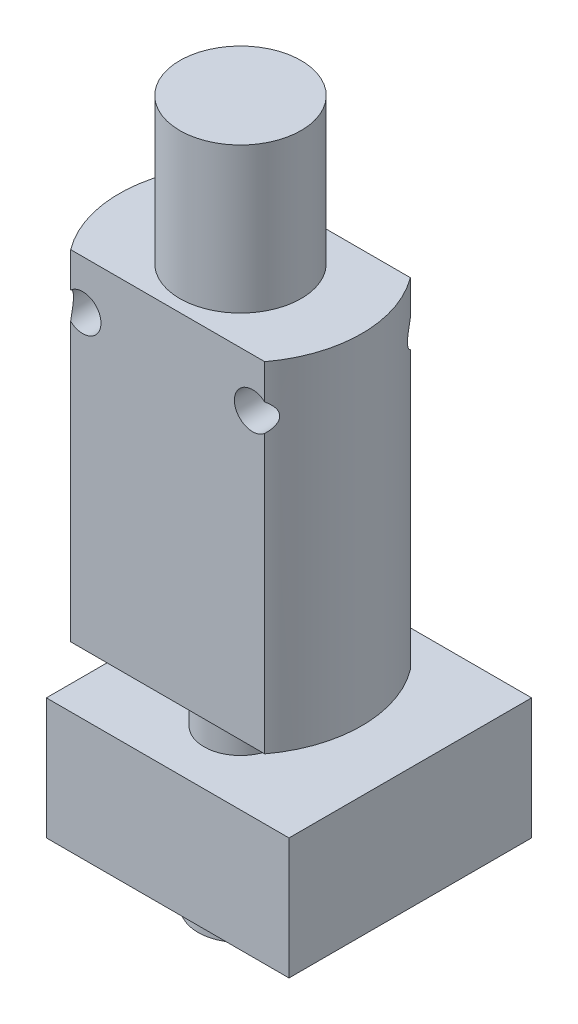
ISO-10303-21;
HEADER;
FILE_DESCRIPTION(('STEP AP214'),'2;1');
FILE_NAME('part.step','',(''),(''),'','','');
FILE_SCHEMA(('AUTOMOTIVE_DESIGN { 1 0 10303 214 1 1 1 1 }'));
ENDSEC;
DATA;
#1=APPLICATION_CONTEXT('core data for automotive mechanical design processes');
#2=APPLICATION_PROTOCOL_DEFINITION('international standard','automotive_design',2000,#1);
#3=PRODUCT_CONTEXT('',#1,'mechanical');
#4=PRODUCT('Part','Part','',(#3));
#5=PRODUCT_RELATED_PRODUCT_CATEGORY('part','',(#4));
#6=PRODUCT_DEFINITION_FORMATION('','',#4);
#7=PRODUCT_DEFINITION_CONTEXT('part definition',#1,'design');
#8=PRODUCT_DEFINITION('design','',#6,#7);
#9=PRODUCT_DEFINITION_SHAPE('','',#8);
#10=(LENGTH_UNIT() NAMED_UNIT(*) SI_UNIT(.MILLI.,.METRE.));
#11=(NAMED_UNIT(*) PLANE_ANGLE_UNIT() SI_UNIT($,.RADIAN.));
#12=(NAMED_UNIT(*) SI_UNIT($,.STERADIAN.) SOLID_ANGLE_UNIT());
#13=UNCERTAINTY_MEASURE_WITH_UNIT(LENGTH_MEASURE(1.E-05),#10,'distance_accuracy_value','');
#14=(GEOMETRIC_REPRESENTATION_CONTEXT(3) GLOBAL_UNCERTAINTY_ASSIGNED_CONTEXT((#13)) GLOBAL_UNIT_ASSIGNED_CONTEXT((#10,
#11,#12)) REPRESENTATION_CONTEXT('',''));
#15=CARTESIAN_POINT('',(0.,0.,0.));
#16=DIRECTION('',(0.,0.,1.));
#17=DIRECTION('',(1.,0.,0.));
#18=AXIS2_PLACEMENT_3D('',#15,#16,#17);
#19=CARTESIAN_POINT('',(-10.,14.,6.));
#20=DIRECTION('',(0.,-1.,0.));
#21=DIRECTION('',(0.,0.,-1.));
#22=AXIS2_PLACEMENT_3D('',#19,#20,#21);
#23=PLANE('',#22);
#24=CARTESIAN_POINT('',(0.,14.,0.));
#25=DIRECTION('',(0.,1.,0.));
#26=DIRECTION('',(0.,0.,1.));
#27=AXIS2_PLACEMENT_3D('',#24,#25,#26);
#28=CIRCLE('',#27,5.);
#29=CARTESIAN_POINT('',(0.,14.,5.));
#30=VERTEX_POINT('',#29);
#31=EDGE_CURVE('E144',#30,#30,#28,.T.);
#32=ORIENTED_EDGE('',*,*,#31,.F.);
#33=EDGE_LOOP('',(#32));
#34=FACE_BOUND('',#33,.T.);
#35=CARTESIAN_POINT('',(0.,14.,0.));
#36=DIRECTION('',(0.,1.,0.));
#37=DIRECTION('',(0.,0.,1.));
#38=AXIS2_PLACEMENT_3D('',#35,#36,#37);
#39=CIRCLE('',#38,9.99999999999999);
#40=CARTESIAN_POINT('',(-7.99999999999999,14.,-6.));
#41=VERTEX_POINT('',#40);
#42=CARTESIAN_POINT('',(-7.99999999999999,14.,6.));
#43=VERTEX_POINT('',#42);
#44=EDGE_CURVE('E121',#41,#43,#39,.T.);
#45=ORIENTED_EDGE('',*,*,#44,.T.);
#46=DIRECTION('',(-1.,0.,0.));
#47=VECTOR('',#46,1.);
#48=CARTESIAN_POINT('',(-10.,14.,6.));
#49=LINE('',#48,#47);
#50=CARTESIAN_POINT('',(7.99999999999999,14.,6.));
#51=VERTEX_POINT('',#50);
#52=EDGE_CURVE('E125',#51,#43,#49,.T.);
#53=ORIENTED_EDGE('',*,*,#52,.F.);
#54=CARTESIAN_POINT('',(0.,14.,0.));
#55=DIRECTION('',(0.,1.,0.));
#56=DIRECTION('',(0.,0.,1.));
#57=AXIS2_PLACEMENT_3D('',#54,#55,#56);
#58=CIRCLE('',#57,9.99999999999999);
#59=CARTESIAN_POINT('',(7.99999999999999,14.,-6.));
#60=VERTEX_POINT('',#59);
#61=EDGE_CURVE('E199',#51,#60,#58,.T.);
#62=ORIENTED_EDGE('',*,*,#61,.T.);
#63=DIRECTION('',(-1.,0.,0.));
#64=VECTOR('',#63,1.);
#65=CARTESIAN_POINT('',(-10.,14.,-6.));
#66=LINE('',#65,#64);
#67=EDGE_CURVE('E127',#60,#41,#66,.T.);
#68=ORIENTED_EDGE('',*,*,#67,.T.);
#69=EDGE_LOOP('',(#45,#53,#62,#68));
#70=FACE_BOUND('',#69,.T.);
#71=ADVANCED_FACE('F33',(#34,#70),#23,.F.);
#72=CARTESIAN_POINT('',(-10.,-14.,6.));
#73=DIRECTION('',(0.,1.,0.));
#74=DIRECTION('',(0.,0.,1.));
#75=AXIS2_PLACEMENT_3D('',#72,#73,#74);
#76=PLANE('',#75);
#77=CARTESIAN_POINT('',(0.,-14.,0.));
#78=DIRECTION('',(0.,1.,0.));
#79=DIRECTION('',(0.,0.,1.));
#80=AXIS2_PLACEMENT_3D('',#77,#78,#79);
#81=CIRCLE('',#80,3.);
#82=CARTESIAN_POINT('',(0.,-14.,3.));
#83=VERTEX_POINT('',#82);
#84=EDGE_CURVE('E223',#83,#83,#81,.T.);
#85=ORIENTED_EDGE('',*,*,#84,.T.);
#86=EDGE_LOOP('',(#85));
#87=FACE_BOUND('',#86,.T.);
#88=DIRECTION('',(1.,0.,0.));
#89=VECTOR('',#88,1.);
#90=CARTESIAN_POINT('',(-10.,-14.,6.));
#91=LINE('',#90,#89);
#92=CARTESIAN_POINT('',(-7.99999999999999,-14.,6.));
#93=VERTEX_POINT('',#92);
#94=CARTESIAN_POINT('',(7.99999999999999,-14.,6.));
#95=VERTEX_POINT('',#94);
#96=EDGE_CURVE('E140',#93,#95,#91,.T.);
#97=ORIENTED_EDGE('',*,*,#96,.F.);
#98=CARTESIAN_POINT('',(0.,-14.,0.));
#99=DIRECTION('',(0.,1.,0.));
#100=DIRECTION('',(0.,0.,1.));
#101=AXIS2_PLACEMENT_3D('',#98,#99,#100);
#102=CIRCLE('',#101,9.99999999999999);
#103=CARTESIAN_POINT('',(-7.99999999999999,-14.,-6.));
#104=VERTEX_POINT('',#103);
#105=EDGE_CURVE('E200',#93,#104,#102,.F.);
#106=ORIENTED_EDGE('',*,*,#105,.T.);
#107=DIRECTION('',(1.,0.,0.));
#108=VECTOR('',#107,1.);
#109=CARTESIAN_POINT('',(-10.,-14.,-6.));
#110=LINE('',#109,#108);
#111=CARTESIAN_POINT('',(7.99999999999999,-14.,-6.));
#112=VERTEX_POINT('',#111);
#113=EDGE_CURVE('E141',#104,#112,#110,.T.);
#114=ORIENTED_EDGE('',*,*,#113,.T.);
#115=CARTESIAN_POINT('',(0.,-14.,0.));
#116=DIRECTION('',(0.,1.,0.));
#117=DIRECTION('',(0.,0.,1.));
#118=AXIS2_PLACEMENT_3D('',#115,#116,#117);
#119=CIRCLE('',#118,9.99999999999999);
#120=EDGE_CURVE('E128',#112,#95,#119,.F.);
#121=ORIENTED_EDGE('',*,*,#120,.T.);
#122=EDGE_LOOP('',(#97,#106,#114,#121));
#123=FACE_BOUND('',#122,.T.);
#124=ADVANCED_FACE('F205',(#87,#123),#76,.F.);
#125=CARTESIAN_POINT('',(-7.,10.,6.));
#126=DIRECTION('',(0.,0.,-1.));
#127=DIRECTION('',(-1.,0.,0.));
#128=AXIS2_PLACEMENT_3D('',#125,#126,#127);
#129=CYLINDRICAL_SURFACE('',#128,1.5);
#130=CARTESIAN_POINT('',(-7.,10.,-6.));
#131=DIRECTION('',(0.,0.,1.));
#132=DIRECTION('',(1.,0.,0.));
#133=AXIS2_PLACEMENT_3D('',#130,#131,#132);
#134=CIRCLE('',#133,1.5);
#135=CARTESIAN_POINT('',(-7.99999999999999,8.8819660112501,-6.));
#136=VERTEX_POINT('',#135);
#137=CARTESIAN_POINT('',(-7.99999999999999,11.1180339887499,-6.));
#138=VERTEX_POINT('',#137);
#139=EDGE_CURVE('E149',#136,#138,#134,.T.);
#140=ORIENTED_EDGE('',*,*,#139,.F.);
#141=CARTESIAN_POINT('',(-7.99999999999999,8.8819660112501,-6.));
#142=CARTESIAN_POINT('',(-8.03319709795339,8.91168999587392,-5.95574757794856));
#143=CARTESIAN_POINT('',(-8.06547382531949,8.94319406453813,-5.91193650763562));
#144=CARTESIAN_POINT('',(-8.12806349588235,9.01024924885044,-5.82558234333872));
#145=CARTESIAN_POINT('',(-8.15836573250745,9.04581994379503,-5.78304674477553));
#146=CARTESIAN_POINT('',(-8.21709784680618,9.12192094350839,-5.6992959478821));
#147=CARTESIAN_POINT('',(-8.24548102185268,9.16253286471241,-5.65812137582313));
#148=CARTESIAN_POINT('',(-8.2991820476017,9.24853986586232,-5.57905460198178));
#149=CARTESIAN_POINT('',(-8.32450671243462,9.29392387521647,-5.54115515917385));
#150=CARTESIAN_POINT('',(-8.36858418886494,9.3842199558626,-5.47432222692192));
#151=CARTESIAN_POINT('',(-8.38776138312471,9.42852544710386,-5.44485872774962));
#152=CARTESIAN_POINT('',(-8.42243915145812,9.52134456248971,-5.39106107623512));
#153=CARTESIAN_POINT('',(-8.43795154621582,9.56984394823762,-5.36671046153633));
#154=CARTESIAN_POINT('',(-8.46460110637092,9.67174421117296,-5.32458104602582));
#155=CARTESIAN_POINT('',(-8.47567021392915,9.72520694015195,-5.30690470094116));
#156=CARTESIAN_POINT('',(-8.49194866496654,9.83520431252895,-5.28081977259772));
#157=CARTESIAN_POINT('',(-8.49716945739679,9.89173272601723,-5.27239308241005));
#158=CARTESIAN_POINT('',(-8.50081944583781,9.99819648261795,-5.26650508032341));
#159=CARTESIAN_POINT('',(-8.50004219971293,10.0480352597205,-5.26776248596406));
#160=CARTESIAN_POINT('',(-8.49363811880348,10.146587853215,-5.27808168264521));
#161=CARTESIAN_POINT('',(-8.48800735531078,10.1953007254282,-5.28714979610468));
#162=CARTESIAN_POINT('',(-8.47127513329529,10.2973459180014,-5.31392281268726));
#163=CARTESIAN_POINT('',(-8.45947758401049,10.3502693365455,-5.33272261032079));
#164=CARTESIAN_POINT('',(-8.43130597602798,10.4518344295103,-5.37715277375631));
#165=CARTESIAN_POINT('',(-8.41492382133668,10.5004683273753,-5.40279521929137));
#166=CARTESIAN_POINT('',(-8.36861987041464,10.6187450069766,-5.47438161937196));
#167=CARTESIAN_POINT('',(-8.33619690891963,10.6853035208725,-5.52375215997205));
#168=CARTESIAN_POINT('',(-8.26517248972191,10.8089780262943,-5.62947761030729));
#169=CARTESIAN_POINT('',(-8.22655015352859,10.8660607343773,-5.6858559711276));
#170=CARTESIAN_POINT('',(-8.15666561018673,10.9562121489143,-5.78544215884129));
#171=CARTESIAN_POINT('',(-8.12660113188093,10.9913924316923,-5.82761873016638));
#172=CARTESIAN_POINT('',(-8.06464717168066,11.0576149614166,-5.91305749310683));
#173=CARTESIAN_POINT('',(-8.0327762062478,11.0886910901623,-5.95630676548155));
#174=CARTESIAN_POINT('',(-8.,11.1180339887499,-6.));
#175=B_SPLINE_CURVE_WITH_KNOTS('',3,(#141,#142,#143,#144,#145,#146,#147,#148,#149,#150,#151,
#152,#153,#154,#155,#156,#157,#158,#159,#160,#161,#162,#163,#164,#165,#166,#167,#168,#169,#170,
#171,#172,#173,#174),.UNSPECIFIED.,.F.,.F.,(4,2,2,2,2,2,2,2,2,2,2,2,2,2,2,2,4),(0.,
0.188433784760338,0.377816388273991,0.570809072083472,0.76336352449458,0.932633231778437,
1.10134927478578,1.27255905579028,1.44343307910128,1.59212863584515,1.7409446682314,
1.9121689192985,2.08369746568321,2.34918211584102,2.6155803962468,2.80325566076793,
2.98926916684157),.UNSPECIFIED.);
#176=EDGE_CURVE('E40',#136,#138,#175,.T.);
#177=ORIENTED_EDGE('',*,*,#176,.T.);
#178=EDGE_LOOP('',(#140,#177));
#179=FACE_BOUND('',#178,.T.);
#180=CARTESIAN_POINT('',(-7.,10.,6.));
#181=DIRECTION('',(0.,0.,1.));
#182=DIRECTION('',(1.,0.,0.));
#183=AXIS2_PLACEMENT_3D('',#180,#181,#182);
#184=CIRCLE('',#183,1.5);
#185=CARTESIAN_POINT('',(-7.99999999999999,8.8819660112501,6.));
#186=VERTEX_POINT('',#185);
#187=CARTESIAN_POINT('',(-7.99999999999999,11.1180339887499,6.));
#188=VERTEX_POINT('',#187);
#189=EDGE_CURVE('E152',#186,#188,#184,.T.);
#190=ORIENTED_EDGE('',*,*,#189,.T.);
#191=CARTESIAN_POINT('',(-7.99999999999999,11.1180339887499,6.));
#192=CARTESIAN_POINT('',(-8.03319709795339,11.0883100041261,5.95574757794856));
#193=CARTESIAN_POINT('',(-8.06547382531949,11.0568059354619,5.91193650763562));
#194=CARTESIAN_POINT('',(-8.12806349588235,10.9897507511496,5.82558234333872));
#195=CARTESIAN_POINT('',(-8.15836573250745,10.954180056205,5.78304674477553));
#196=CARTESIAN_POINT('',(-8.21709784680617,10.8780790564916,5.6992959478821));
#197=CARTESIAN_POINT('',(-8.24548102185268,10.8374671352876,5.65812137582313));
#198=CARTESIAN_POINT('',(-8.2991820476017,10.7514601341377,5.57905460198178));
#199=CARTESIAN_POINT('',(-8.32450671243462,10.7060761247835,5.54115515917385));
#200=CARTESIAN_POINT('',(-8.36858418886494,10.6157800441374,5.47432222692192));
#201=CARTESIAN_POINT('',(-8.38776138312471,10.5714745528961,5.44485872774962));
#202=CARTESIAN_POINT('',(-8.42243915145812,10.4786554375103,5.39106107623512));
#203=CARTESIAN_POINT('',(-8.43795154621582,10.4301560517624,5.36671046153633));
#204=CARTESIAN_POINT('',(-8.46460110637092,10.328255788827,5.32458104602582));
#205=CARTESIAN_POINT('',(-8.47567021392915,10.274793059848,5.30690470094116));
#206=CARTESIAN_POINT('',(-8.49194866496654,10.164795687471,5.28081977259772));
#207=CARTESIAN_POINT('',(-8.49716945739679,10.1082672739828,5.27239308241005));
#208=CARTESIAN_POINT('',(-8.50081944583781,10.001803517382,5.26650508032341));
#209=CARTESIAN_POINT('',(-8.50004219971293,9.95196474027946,5.26776248596406));
#210=CARTESIAN_POINT('',(-8.49363811880348,9.85341214678495,5.27808168264521));
#211=CARTESIAN_POINT('',(-8.48800735531078,9.80469927457184,5.28714979610468));
#212=CARTESIAN_POINT('',(-8.47127513329529,9.70265408199865,5.31392281268726));
#213=CARTESIAN_POINT('',(-8.45947758401049,9.64973066345448,5.33272261032079));
#214=CARTESIAN_POINT('',(-8.43130597602798,9.54816557048967,5.37715277375631));
#215=CARTESIAN_POINT('',(-8.41492382133668,9.49953167262469,5.40279521929137));
#216=CARTESIAN_POINT('',(-8.36861987041464,9.38125499302338,5.47438161937196));
#217=CARTESIAN_POINT('',(-8.33619690891963,9.31469647912746,5.52375215997205));
#218=CARTESIAN_POINT('',(-8.26517248972191,9.1910219737057,5.62947761030729));
#219=CARTESIAN_POINT('',(-8.22655015352859,9.13393926562267,5.6858559711276));
#220=CARTESIAN_POINT('',(-8.15666561018673,9.04378785108572,5.78544215884129));
#221=CARTESIAN_POINT('',(-8.12660113188093,9.00860756830766,5.82761873016638));
#222=CARTESIAN_POINT('',(-8.06464717168066,8.94238503858345,5.91305749310683));
#223=CARTESIAN_POINT('',(-8.0327762062478,8.9113089098377,5.95630676548154));
#224=CARTESIAN_POINT('',(-8.,8.8819660112501,6.));
#225=B_SPLINE_CURVE_WITH_KNOTS('',3,(#191,#192,#193,#194,#195,#196,#197,#198,#199,#200,#201,
#202,#203,#204,#205,#206,#207,#208,#209,#210,#211,#212,#213,#214,#215,#216,#217,#218,#219,#220,
#221,#222,#223,#224),.UNSPECIFIED.,.F.,.F.,(4,2,2,2,2,2,2,2,2,2,2,2,2,2,2,2,4),(0.,
0.188433784760338,0.377816388273991,0.570809072083472,0.76336352449458,0.932633231778437,
1.10134927478578,1.27255905579028,1.44343307910128,1.59212863584515,1.7409446682314,
1.9121689192985,2.08369746568321,2.34918211584102,2.6155803962468,2.80325566076793,
2.98926916684157),.UNSPECIFIED.);
#226=EDGE_CURVE('E132',#188,#186,#225,.T.);
#227=ORIENTED_EDGE('',*,*,#226,.T.);
#228=EDGE_LOOP('',(#190,#227));
#229=FACE_BOUND('',#228,.T.);
#230=ADVANCED_FACE('F201',(#179,#229),#129,.F.);
#231=CARTESIAN_POINT('',(7.,10.,6.));
#232=DIRECTION('',(0.,0.,-1.));
#233=DIRECTION('',(-1.,0.,0.));
#234=AXIS2_PLACEMENT_3D('',#231,#232,#233);
#235=CYLINDRICAL_SURFACE('',#234,1.5);
#236=CARTESIAN_POINT('',(7.,10.,-6.));
#237=DIRECTION('',(0.,0.,1.));
#238=DIRECTION('',(-1.,0.,0.));
#239=AXIS2_PLACEMENT_3D('',#236,#237,#238);
#240=CIRCLE('',#239,1.5);
#241=CARTESIAN_POINT('',(7.99999999999999,11.1180339887499,-6.));
#242=VERTEX_POINT('',#241);
#243=CARTESIAN_POINT('',(7.99999999999999,8.8819660112501,-6.));
#244=VERTEX_POINT('',#243);
#245=EDGE_CURVE('E235',#242,#244,#240,.T.);
#246=ORIENTED_EDGE('',*,*,#245,.F.);
#247=CARTESIAN_POINT('',(7.99999999999999,11.1180339887499,-6.));
#248=CARTESIAN_POINT('',(8.03319709795339,11.0883100041261,-5.95574757794856));
#249=CARTESIAN_POINT('',(8.06547382531949,11.0568059354619,-5.91193650763563));
#250=CARTESIAN_POINT('',(8.12806349588235,10.9897507511496,-5.82558234333872));
#251=CARTESIAN_POINT('',(8.15836573250745,10.954180056205,-5.78304674477553));
#252=CARTESIAN_POINT('',(8.21709784680618,10.8780790564916,-5.69929594788209));
#253=CARTESIAN_POINT('',(8.24548102185268,10.8374671352876,-5.65812137582313));
#254=CARTESIAN_POINT('',(8.2991820476017,10.7514601341377,-5.57905460198178));
#255=CARTESIAN_POINT('',(8.32450671243462,10.7060761247835,-5.54115515917385));
#256=CARTESIAN_POINT('',(8.36858418886494,10.6157800441374,-5.47432222692192));
#257=CARTESIAN_POINT('',(8.38776138312471,10.5714745528961,-5.44485872774962));
#258=CARTESIAN_POINT('',(8.42243915145811,10.4786554375103,-5.39106107623512));
#259=CARTESIAN_POINT('',(8.43795154621582,10.4301560517624,-5.36671046153633));
#260=CARTESIAN_POINT('',(8.46460110637092,10.328255788827,-5.32458104602582));
#261=CARTESIAN_POINT('',(8.47567021392915,10.274793059848,-5.30690470094116));
#262=CARTESIAN_POINT('',(8.49194866496654,10.164795687471,-5.28081977259772));
#263=CARTESIAN_POINT('',(8.49716945739679,10.1082672739828,-5.27239308241005));
#264=CARTESIAN_POINT('',(8.50081944583781,10.001803517382,-5.26650508032341));
#265=CARTESIAN_POINT('',(8.50004219971293,9.95196474027946,-5.26776248596406));
#266=CARTESIAN_POINT('',(8.49363811880348,9.85341214678495,-5.27808168264521));
#267=CARTESIAN_POINT('',(8.48800735531078,9.80469927457184,-5.28714979610468));
#268=CARTESIAN_POINT('',(8.47127513329529,9.70265408199865,-5.31392281268726));
#269=CARTESIAN_POINT('',(8.45947758401049,9.64973066345448,-5.33272261032079));
#270=CARTESIAN_POINT('',(8.43130597602798,9.54816557048968,-5.37715277375631));
#271=CARTESIAN_POINT('',(8.41492382133668,9.49953167262469,-5.40279521929137));
#272=CARTESIAN_POINT('',(8.36861987041464,9.38125499302338,-5.47438161937196));
#273=CARTESIAN_POINT('',(8.33619690891963,9.31469647912746,-5.52375215997205));
#274=CARTESIAN_POINT('',(8.26517248972191,9.1910219737057,-5.62947761030729));
#275=CARTESIAN_POINT('',(8.22655015352859,9.13393926562267,-5.6858559711276));
#276=CARTESIAN_POINT('',(8.15666561018673,9.04378785108572,-5.78544215884129));
#277=CARTESIAN_POINT('',(8.12660113188092,9.00860756830766,-5.82761873016638));
#278=CARTESIAN_POINT('',(8.06464717168066,8.94238503858345,-5.91305749310683));
#279=CARTESIAN_POINT('',(8.03277620624779,8.9113089098377,-5.95630676548155));
#280=CARTESIAN_POINT('',(7.99999999999999,8.8819660112501,-6.));
#281=B_SPLINE_CURVE_WITH_KNOTS('',3,(#247,#248,#249,#250,#251,#252,#253,#254,#255,#256,#257,
#258,#259,#260,#261,#262,#263,#264,#265,#266,#267,#268,#269,#270,#271,#272,#273,#274,#275,#276,
#277,#278,#279,#280),.UNSPECIFIED.,.F.,.F.,(4,2,2,2,2,2,2,2,2,2,2,2,2,2,2,2,4),(0.,
0.188433784760337,0.377816388273991,0.570809072083475,0.763363524494579,0.932633231778435,
1.10134927478578,1.27255905579028,1.44343307910128,1.59212863584514,1.7409446682314,
1.91216891929849,2.08369746568321,2.34918211584102,2.6155803962468,2.80325566076793,
2.98926916684157),.UNSPECIFIED.);
#282=EDGE_CURVE('E157',#242,#244,#281,.T.);
#283=ORIENTED_EDGE('',*,*,#282,.T.);
#284=EDGE_LOOP('',(#246,#283));
#285=FACE_BOUND('',#284,.T.);
#286=CARTESIAN_POINT('',(7.,10.,6.));
#287=DIRECTION('',(0.,0.,1.));
#288=DIRECTION('',(-1.,0.,0.));
#289=AXIS2_PLACEMENT_3D('',#286,#287,#288);
#290=CIRCLE('',#289,1.5);
#291=CARTESIAN_POINT('',(7.99999999999999,11.1180339887499,6.));
#292=VERTEX_POINT('',#291);
#293=CARTESIAN_POINT('',(7.99999999999999,8.8819660112501,6.));
#294=VERTEX_POINT('',#293);
#295=EDGE_CURVE('E233',#292,#294,#290,.T.);
#296=ORIENTED_EDGE('',*,*,#295,.T.);
#297=CARTESIAN_POINT('',(7.99999999999999,8.8819660112501,6.));
#298=CARTESIAN_POINT('',(8.03319709795339,8.91168999587392,5.95574757794856));
#299=CARTESIAN_POINT('',(8.06547382531949,8.94319406453813,5.91193650763563));
#300=CARTESIAN_POINT('',(8.12806349588235,9.01024924885044,5.82558234333872));
#301=CARTESIAN_POINT('',(8.15836573250745,9.04581994379503,5.78304674477553));
#302=CARTESIAN_POINT('',(8.21709784680618,9.12192094350839,5.69929594788209));
#303=CARTESIAN_POINT('',(8.24548102185268,9.16253286471241,5.65812137582313));
#304=CARTESIAN_POINT('',(8.2991820476017,9.24853986586232,5.57905460198178));
#305=CARTESIAN_POINT('',(8.32450671243462,9.29392387521647,5.54115515917385));
#306=CARTESIAN_POINT('',(8.36858418886494,9.3842199558626,5.47432222692192));
#307=CARTESIAN_POINT('',(8.38776138312471,9.42852544710387,5.44485872774962));
#308=CARTESIAN_POINT('',(8.42243915145811,9.52134456248971,5.39106107623512));
#309=CARTESIAN_POINT('',(8.43795154621582,9.56984394823762,5.36671046153633));
#310=CARTESIAN_POINT('',(8.46460110637092,9.67174421117296,5.32458104602582));
#311=CARTESIAN_POINT('',(8.47567021392915,9.72520694015195,5.30690470094116));
#312=CARTESIAN_POINT('',(8.49194866496654,9.83520431252895,5.28081977259772));
#313=CARTESIAN_POINT('',(8.49716945739679,9.89173272601723,5.27239308241005));
#314=CARTESIAN_POINT('',(8.50081944583781,9.99819648261795,5.26650508032341));
#315=CARTESIAN_POINT('',(8.50004219971293,10.0480352597205,5.26776248596406));
#316=CARTESIAN_POINT('',(8.49363811880348,10.146587853215,5.27808168264521));
#317=CARTESIAN_POINT('',(8.48800735531078,10.1953007254282,5.28714979610468));
#318=CARTESIAN_POINT('',(8.47127513329529,10.2973459180014,5.31392281268726));
#319=CARTESIAN_POINT('',(8.45947758401049,10.3502693365455,5.33272261032079));
#320=CARTESIAN_POINT('',(8.43130597602798,10.4518344295103,5.37715277375631));
#321=CARTESIAN_POINT('',(8.41492382133668,10.5004683273753,5.40279521929137));
#322=CARTESIAN_POINT('',(8.36861987041464,10.6187450069766,5.47438161937196));
#323=CARTESIAN_POINT('',(8.33619690891963,10.6853035208725,5.52375215997205));
#324=CARTESIAN_POINT('',(8.26517248972191,10.8089780262943,5.62947761030729));
#325=CARTESIAN_POINT('',(8.22655015352859,10.8660607343773,5.6858559711276));
#326=CARTESIAN_POINT('',(8.15666561018673,10.9562121489143,5.78544215884129));
#327=CARTESIAN_POINT('',(8.12660113188092,10.9913924316923,5.82761873016639));
#328=CARTESIAN_POINT('',(8.06464717168066,11.0576149614166,5.91305749310683));
#329=CARTESIAN_POINT('',(8.03277620624779,11.0886910901623,5.95630676548155));
#330=CARTESIAN_POINT('',(7.99999999999999,11.1180339887499,6.));
#331=B_SPLINE_CURVE_WITH_KNOTS('',3,(#297,#298,#299,#300,#301,#302,#303,#304,#305,#306,#307,
#308,#309,#310,#311,#312,#313,#314,#315,#316,#317,#318,#319,#320,#321,#322,#323,#324,#325,#326,
#327,#328,#329,#330),.UNSPECIFIED.,.F.,.F.,(4,2,2,2,2,2,2,2,2,2,2,2,2,2,2,2,4),(0.,
0.188433784760337,0.377816388273991,0.570809072083475,0.763363524494579,0.932633231778435,
1.10134927478578,1.27255905579028,1.44343307910128,1.59212863584514,1.7409446682314,
1.91216891929849,2.0836974656832,2.34918211584102,2.6155803962468,2.80325566076794,
2.98926916684157),.UNSPECIFIED.);
#332=EDGE_CURVE('E183',#294,#292,#331,.T.);
#333=ORIENTED_EDGE('',*,*,#332,.T.);
#334=EDGE_LOOP('',(#296,#333));
#335=FACE_BOUND('',#334,.T.);
#336=ADVANCED_FACE('F170',(#285,#335),#235,.F.);
#337=CARTESIAN_POINT('',(0.,0.,6.));
#338=DIRECTION('',(0.,0.,1.));
#339=DIRECTION('',(1.,0.,0.));
#340=AXIS2_PLACEMENT_3D('',#337,#338,#339);
#341=PLANE('',#340);
#342=ORIENTED_EDGE('',*,*,#52,.T.);
#343=DIRECTION('',(0.,1.,0.));
#344=VECTOR('',#343,1.);
#345=CARTESIAN_POINT('',(-7.99999999999999,-20.3245553203368,6.));
#346=LINE('',#345,#344);
#347=EDGE_CURVE('E11',#43,#188,#346,.F.);
#348=ORIENTED_EDGE('',*,*,#347,.T.);
#349=ORIENTED_EDGE('',*,*,#189,.F.);
#350=DIRECTION('',(0.,1.,0.));
#351=VECTOR('',#350,1.);
#352=CARTESIAN_POINT('',(-7.99999999999999,-20.3245553203368,6.));
#353=LINE('',#352,#351);
#354=EDGE_CURVE('E191',#93,#186,#353,.T.);
#355=ORIENTED_EDGE('',*,*,#354,.F.);
#356=ORIENTED_EDGE('',*,*,#96,.T.);
#357=DIRECTION('',(0.,1.,0.));
#358=VECTOR('',#357,1.);
#359=CARTESIAN_POINT('',(7.99999999999999,-20.3245553203368,6.));
#360=LINE('',#359,#358);
#361=EDGE_CURVE('E192',#95,#294,#360,.T.);
#362=ORIENTED_EDGE('',*,*,#361,.T.);
#363=ORIENTED_EDGE('',*,*,#295,.F.);
#364=EDGE_CURVE('E139',#292,#51,#360,.T.);
#365=ORIENTED_EDGE('',*,*,#364,.T.);
#366=EDGE_LOOP('',(#342,#348,#349,#355,#356,#362,#363,#365));
#367=FACE_BOUND('',#366,.T.);
#368=ADVANCED_FACE('F137',(#367),#341,.T.);
#369=CARTESIAN_POINT('',(0.,0.,-6.));
#370=DIRECTION('',(0.,0.,1.));
#371=DIRECTION('',(1.,0.,0.));
#372=AXIS2_PLACEMENT_3D('',#369,#370,#371);
#373=PLANE('',#372);
#374=DIRECTION('',(0.,1.,0.));
#375=VECTOR('',#374,1.);
#376=CARTESIAN_POINT('',(-7.99999999999999,-20.3245553203368,-6.));
#377=LINE('',#376,#375);
#378=EDGE_CURVE('E47',#138,#41,#377,.T.);
#379=ORIENTED_EDGE('',*,*,#378,.T.);
#380=ORIENTED_EDGE('',*,*,#67,.F.);
#381=DIRECTION('',(0.,1.,0.));
#382=VECTOR('',#381,1.);
#383=CARTESIAN_POINT('',(7.99999999999999,-20.3245553203368,-6.));
#384=LINE('',#383,#382);
#385=EDGE_CURVE('E287',#242,#60,#384,.T.);
#386=ORIENTED_EDGE('',*,*,#385,.F.);
#387=ORIENTED_EDGE('',*,*,#245,.T.);
#388=EDGE_CURVE('E55',#112,#244,#384,.T.);
#389=ORIENTED_EDGE('',*,*,#388,.F.);
#390=ORIENTED_EDGE('',*,*,#113,.F.);
#391=EDGE_CURVE('E290',#104,#136,#377,.T.);
#392=ORIENTED_EDGE('',*,*,#391,.T.);
#393=ORIENTED_EDGE('',*,*,#139,.T.);
#394=EDGE_LOOP('',(#379,#380,#386,#387,#389,#390,#392,#393));
#395=FACE_BOUND('',#394,.T.);
#396=ADVANCED_FACE('F210',(#395),#373,.F.);
#397=CARTESIAN_POINT('',(0.,0.,0.));
#398=DIRECTION('',(0.,1.,0.));
#399=DIRECTION('',(0.,0.,1.));
#400=AXIS2_PLACEMENT_3D('',#397,#398,#399);
#401=CYLINDRICAL_SURFACE('',#400,3.);
#402=ORIENTED_EDGE('',*,*,#84,.F.);
#403=EDGE_LOOP('',(#402));
#404=FACE_BOUND('',#403,.T.);
#405=CARTESIAN_POINT('',(0.,-19.,0.));
#406=DIRECTION('',(0.,-1.,0.));
#407=DIRECTION('',(0.,0.,-1.));
#408=AXIS2_PLACEMENT_3D('',#405,#406,#407);
#409=CIRCLE('',#408,3.);
#410=CARTESIAN_POINT('',(0.,-19.,-3.));
#411=VERTEX_POINT('',#410);
#412=EDGE_CURVE('E154',#411,#411,#409,.T.);
#413=ORIENTED_EDGE('',*,*,#412,.F.);
#414=EDGE_LOOP('',(#413));
#415=FACE_BOUND('',#414,.T.);
#416=ADVANCED_FACE('F212',(#404,#415),#401,.T.);
#417=CARTESIAN_POINT('',(0.,26.,0.));
#418=DIRECTION('',(0.,-1.,0.));
#419=DIRECTION('',(0.,0.,-1.));
#420=AXIS2_PLACEMENT_3D('',#417,#418,#419);
#421=PLANE('',#420);
#422=CARTESIAN_POINT('',(0.,26.,0.));
#423=DIRECTION('',(0.,1.,0.));
#424=DIRECTION('',(0.,0.,1.));
#425=AXIS2_PLACEMENT_3D('',#422,#423,#424);
#426=CIRCLE('',#425,5.);
#427=CARTESIAN_POINT('',(0.,26.,5.));
#428=VERTEX_POINT('',#427);
#429=EDGE_CURVE('E249',#428,#428,#426,.T.);
#430=ORIENTED_EDGE('',*,*,#429,.T.);
#431=EDGE_LOOP('',(#430));
#432=FACE_BOUND('',#431,.T.);
#433=ADVANCED_FACE('F317',(#432),#421,.F.);
#434=CARTESIAN_POINT('',(0.,0.,0.));
#435=DIRECTION('',(0.,1.,0.));
#436=DIRECTION('',(0.,0.,1.));
#437=AXIS2_PLACEMENT_3D('',#434,#435,#436);
#438=CYLINDRICAL_SURFACE('',#437,5.);
#439=ORIENTED_EDGE('',*,*,#429,.F.);
#440=EDGE_LOOP('',(#439));
#441=FACE_BOUND('',#440,.T.);
#442=ORIENTED_EDGE('',*,*,#31,.T.);
#443=EDGE_LOOP('',(#442));
#444=FACE_BOUND('',#443,.T.);
#445=ADVANCED_FACE('F327',(#441,#444),#438,.T.);
#446=CARTESIAN_POINT('',(-10.,-19.,0.));
#447=DIRECTION('',(-1.,0.,0.));
#448=DIRECTION('',(0.,0.,1.));
#449=AXIS2_PLACEMENT_3D('',#446,#447,#448);
#450=PLANE('',#449);
#451=DIRECTION('',(0.,0.,-1.));
#452=VECTOR('',#451,1.);
#453=CARTESIAN_POINT('',(-10.,-29.,0.));
#454=LINE('',#453,#452);
#455=CARTESIAN_POINT('',(-10.,-29.,6.));
#456=VERTEX_POINT('',#455);
#457=CARTESIAN_POINT('',(-10.,-29.,-14.));
#458=VERTEX_POINT('',#457);
#459=EDGE_CURVE('E273',#456,#458,#454,.T.);
#460=ORIENTED_EDGE('',*,*,#459,.F.);
#461=DIRECTION('',(0.,-1.,0.));
#462=VECTOR('',#461,1.);
#463=CARTESIAN_POINT('',(-10.,-19.,6.));
#464=LINE('',#463,#462);
#465=CARTESIAN_POINT('',(-10.,-19.,6.));
#466=VERTEX_POINT('',#465);
#467=EDGE_CURVE('E252',#466,#456,#464,.T.);
#468=ORIENTED_EDGE('',*,*,#467,.F.);
#469=DIRECTION('',(0.,0.,-1.));
#470=VECTOR('',#469,1.);
#471=CARTESIAN_POINT('',(-10.,-19.,0.));
#472=LINE('',#471,#470);
#473=CARTESIAN_POINT('',(-10.,-19.,-14.));
#474=VERTEX_POINT('',#473);
#475=EDGE_CURVE('E266',#466,#474,#472,.T.);
#476=ORIENTED_EDGE('',*,*,#475,.T.);
#477=DIRECTION('',(0.,-1.,0.));
#478=VECTOR('',#477,1.);
#479=CARTESIAN_POINT('',(-10.,-19.,-14.));
#480=LINE('',#479,#478);
#481=EDGE_CURVE('E255',#474,#458,#480,.T.);
#482=ORIENTED_EDGE('',*,*,#481,.T.);
#483=EDGE_LOOP('',(#460,#468,#476,#482));
#484=FACE_BOUND('',#483,.T.);
#485=ADVANCED_FACE('F335',(#484),#450,.T.);
#486=CARTESIAN_POINT('',(3.,-19.,6.));
#487=DIRECTION('',(0.,0.,1.));
#488=DIRECTION('',(1.,0.,0.));
#489=AXIS2_PLACEMENT_3D('',#486,#487,#488);
#490=PLANE('',#489);
#491=DIRECTION('',(-1.,0.,0.));
#492=VECTOR('',#491,1.);
#493=CARTESIAN_POINT('',(3.,-29.,6.));
#494=LINE('',#493,#492);
#495=CARTESIAN_POINT('',(10.,-29.,6.));
#496=VERTEX_POINT('',#495);
#497=EDGE_CURVE('E263',#496,#456,#494,.T.);
#498=ORIENTED_EDGE('',*,*,#497,.F.);
#499=DIRECTION('',(0.,-1.,0.));
#500=VECTOR('',#499,1.);
#501=CARTESIAN_POINT('',(10.,-19.,6.));
#502=LINE('',#501,#500);
#503=CARTESIAN_POINT('',(10.,-19.,6.));
#504=VERTEX_POINT('',#503);
#505=EDGE_CURVE('E260',#504,#496,#502,.T.);
#506=ORIENTED_EDGE('',*,*,#505,.F.);
#507=DIRECTION('',(-1.,0.,0.));
#508=VECTOR('',#507,1.);
#509=CARTESIAN_POINT('',(3.,-19.,6.));
#510=LINE('',#509,#508);
#511=EDGE_CURVE('E258',#504,#466,#510,.T.);
#512=ORIENTED_EDGE('',*,*,#511,.T.);
#513=ORIENTED_EDGE('',*,*,#467,.T.);
#514=EDGE_LOOP('',(#498,#506,#512,#513));
#515=FACE_BOUND('',#514,.T.);
#516=ADVANCED_FACE('F342',(#515),#490,.T.);
#517=CARTESIAN_POINT('',(10.,-19.,0.));
#518=DIRECTION('',(1.,0.,0.));
#519=DIRECTION('',(0.,0.,-1.));
#520=AXIS2_PLACEMENT_3D('',#517,#518,#519);
#521=PLANE('',#520);
#522=DIRECTION('',(0.,0.,1.));
#523=VECTOR('',#522,1.);
#524=CARTESIAN_POINT('',(10.,-29.,0.));
#525=LINE('',#524,#523);
#526=CARTESIAN_POINT('',(10.,-29.,-14.));
#527=VERTEX_POINT('',#526);
#528=EDGE_CURVE('E267',#527,#496,#525,.T.);
#529=ORIENTED_EDGE('',*,*,#528,.F.);
#530=DIRECTION('',(0.,-1.,0.));
#531=VECTOR('',#530,1.);
#532=CARTESIAN_POINT('',(10.,-19.,-14.));
#533=LINE('',#532,#531);
#534=CARTESIAN_POINT('',(10.,-19.,-14.));
#535=VERTEX_POINT('',#534);
#536=EDGE_CURVE('E257',#535,#527,#533,.T.);
#537=ORIENTED_EDGE('',*,*,#536,.F.);
#538=DIRECTION('',(0.,0.,1.));
#539=VECTOR('',#538,1.);
#540=CARTESIAN_POINT('',(10.,-19.,0.));
#541=LINE('',#540,#539);
#542=EDGE_CURVE('E278',#535,#504,#541,.T.);
#543=ORIENTED_EDGE('',*,*,#542,.T.);
#544=ORIENTED_EDGE('',*,*,#505,.T.);
#545=EDGE_LOOP('',(#529,#537,#543,#544));
#546=FACE_BOUND('',#545,.T.);
#547=ADVANCED_FACE('F350',(#546),#521,.T.);
#548=CARTESIAN_POINT('',(3.,-19.,-14.));
#549=DIRECTION('',(0.,0.,-1.));
#550=DIRECTION('',(-1.,0.,0.));
#551=AXIS2_PLACEMENT_3D('',#548,#549,#550);
#552=PLANE('',#551);
#553=DIRECTION('',(1.,0.,0.));
#554=VECTOR('',#553,1.);
#555=CARTESIAN_POINT('',(3.,-29.,-14.));
#556=LINE('',#555,#554);
#557=EDGE_CURVE('E270',#458,#527,#556,.T.);
#558=ORIENTED_EDGE('',*,*,#557,.F.);
#559=ORIENTED_EDGE('',*,*,#481,.F.);
#560=DIRECTION('',(1.,0.,0.));
#561=VECTOR('',#560,1.);
#562=CARTESIAN_POINT('',(3.,-19.,-14.));
#563=LINE('',#562,#561);
#564=EDGE_CURVE('E281',#474,#535,#563,.T.);
#565=ORIENTED_EDGE('',*,*,#564,.T.);
#566=ORIENTED_EDGE('',*,*,#536,.T.);
#567=EDGE_LOOP('',(#558,#559,#565,#566));
#568=FACE_BOUND('',#567,.T.);
#569=ADVANCED_FACE('F358',(#568),#552,.T.);
#570=CARTESIAN_POINT('',(0.,-19.,0.));
#571=DIRECTION('',(0.,-1.,0.));
#572=DIRECTION('',(0.,0.,-1.));
#573=AXIS2_PLACEMENT_3D('',#570,#571,#572);
#574=PLANE('',#573);
#575=ORIENTED_EDGE('',*,*,#412,.T.);
#576=EDGE_LOOP('',(#575));
#577=FACE_BOUND('',#576,.T.);
#578=ORIENTED_EDGE('',*,*,#475,.F.);
#579=ORIENTED_EDGE('',*,*,#511,.F.);
#580=ORIENTED_EDGE('',*,*,#542,.F.);
#581=ORIENTED_EDGE('',*,*,#564,.F.);
#582=EDGE_LOOP('',(#578,#579,#580,#581));
#583=FACE_BOUND('',#582,.T.);
#584=ADVANCED_FACE('F179',(#577,#583),#574,.F.);
#585=CARTESIAN_POINT('',(0.,-29.,0.));
#586=DIRECTION('',(0.,-1.,0.));
#587=DIRECTION('',(0.,0.,-1.));
#588=AXIS2_PLACEMENT_3D('',#585,#586,#587);
#589=PLANE('',#588);
#590=CARTESIAN_POINT('',(0.,-29.,0.));
#591=DIRECTION('',(0.,1.,0.));
#592=DIRECTION('',(0.,0.,1.));
#593=AXIS2_PLACEMENT_3D('',#590,#591,#592);
#594=CIRCLE('',#593,3.5);
#595=CARTESIAN_POINT('',(0.,-29.,3.5));
#596=VERTEX_POINT('',#595);
#597=EDGE_CURVE('E245',#596,#596,#594,.T.);
#598=ORIENTED_EDGE('',*,*,#597,.T.);
#599=EDGE_LOOP('',(#598));
#600=FACE_BOUND('',#599,.T.);
#601=ORIENTED_EDGE('',*,*,#459,.T.);
#602=ORIENTED_EDGE('',*,*,#557,.T.);
#603=ORIENTED_EDGE('',*,*,#528,.T.);
#604=ORIENTED_EDGE('',*,*,#497,.T.);
#605=EDGE_LOOP('',(#601,#602,#603,#604));
#606=FACE_BOUND('',#605,.T.);
#607=ADVANCED_FACE('F373',(#600,#606),#589,.T.);
#608=CARTESIAN_POINT('',(0.750000000000004,-34.,0.));
#609=DIRECTION('',(0.,1.,0.));
#610=DIRECTION('',(0.,0.,1.));
#611=AXIS2_PLACEMENT_3D('',#608,#609,#610);
#612=PLANE('',#611);
#613=CARTESIAN_POINT('',(0.,-34.,0.));
#614=DIRECTION('',(0.,1.,0.));
#615=DIRECTION('',(0.,0.,1.));
#616=AXIS2_PLACEMENT_3D('',#613,#614,#615);
#617=CIRCLE('',#616,0.750000000000004);
#618=CARTESIAN_POINT('',(0.,-34.,0.750000000000004));
#619=VERTEX_POINT('',#618);
#620=EDGE_CURVE('E238',#619,#619,#617,.T.);
#621=ORIENTED_EDGE('',*,*,#620,.F.);
#622=EDGE_LOOP('',(#621));
#623=FACE_BOUND('',#622,.T.);
#624=ADVANCED_FACE('F380',(#623),#612,.F.);
#625=CARTESIAN_POINT('',(0.,-34.,0.));
#626=DIRECTION('',(0.,1.,0.));
#627=DIRECTION('',(0.,0.,1.));
#628=AXIS2_PLACEMENT_3D('',#625,#626,#627);
#629=CONICAL_SURFACE('',#628,0.750000000000004,0.942000040379465);
#630=CARTESIAN_POINT('',(0.,-32.,0.));
#631=DIRECTION('',(0.,1.,0.));
#632=DIRECTION('',(0.,0.,1.));
#633=AXIS2_PLACEMENT_3D('',#630,#631,#632);
#634=CIRCLE('',#633,3.5);
#635=CARTESIAN_POINT('',(0.,-32.,3.5));
#636=VERTEX_POINT('',#635);
#637=EDGE_CURVE('E242',#636,#636,#634,.T.);
#638=ORIENTED_EDGE('',*,*,#637,.F.);
#639=EDGE_LOOP('',(#638));
#640=FACE_BOUND('',#639,.T.);
#641=ORIENTED_EDGE('',*,*,#620,.T.);
#642=EDGE_LOOP('',(#641));
#643=FACE_BOUND('',#642,.T.);
#644=ADVANCED_FACE('F388',(#640,#643),#629,.T.);
#645=CARTESIAN_POINT('',(0.,0.,0.));
#646=DIRECTION('',(0.,1.,0.));
#647=DIRECTION('',(0.,0.,1.));
#648=AXIS2_PLACEMENT_3D('',#645,#646,#647);
#649=CYLINDRICAL_SURFACE('',#648,3.5);
#650=ORIENTED_EDGE('',*,*,#597,.F.);
#651=EDGE_LOOP('',(#650));
#652=FACE_BOUND('',#651,.T.);
#653=ORIENTED_EDGE('',*,*,#637,.T.);
#654=EDGE_LOOP('',(#653));
#655=FACE_BOUND('',#654,.T.);
#656=ADVANCED_FACE('F177',(#652,#655),#649,.T.);
#657=CARTESIAN_POINT('',(0.,-20.3245553203368,0.));
#658=DIRECTION('',(0.,1.,0.));
#659=DIRECTION('',(0.,0.,1.));
#660=AXIS2_PLACEMENT_3D('',#657,#658,#659);
#661=CYLINDRICAL_SURFACE('',#660,9.99999999999999);
#662=ORIENTED_EDGE('',*,*,#385,.T.);
#663=ORIENTED_EDGE('',*,*,#61,.F.);
#664=ORIENTED_EDGE('',*,*,#364,.F.);
#665=ORIENTED_EDGE('',*,*,#332,.F.);
#666=ORIENTED_EDGE('',*,*,#361,.F.);
#667=ORIENTED_EDGE('',*,*,#120,.F.);
#668=ORIENTED_EDGE('',*,*,#388,.T.);
#669=ORIENTED_EDGE('',*,*,#282,.F.);
#670=EDGE_LOOP('',(#662,#663,#664,#665,#666,#667,#668,#669));
#671=FACE_BOUND('',#670,.T.);
#672=ADVANCED_FACE('F173',(#671),#661,.T.);
#673=CARTESIAN_POINT('',(0.,-20.3245553203368,0.));
#674=DIRECTION('',(0.,1.,0.));
#675=DIRECTION('',(0.,0.,1.));
#676=AXIS2_PLACEMENT_3D('',#673,#674,#675);
#677=CYLINDRICAL_SURFACE('',#676,9.99999999999999);
#678=ORIENTED_EDGE('',*,*,#391,.F.);
#679=ORIENTED_EDGE('',*,*,#105,.F.);
#680=ORIENTED_EDGE('',*,*,#354,.T.);
#681=ORIENTED_EDGE('',*,*,#226,.F.);
#682=ORIENTED_EDGE('',*,*,#347,.F.);
#683=ORIENTED_EDGE('',*,*,#44,.F.);
#684=ORIENTED_EDGE('',*,*,#378,.F.);
#685=ORIENTED_EDGE('',*,*,#176,.F.);
#686=EDGE_LOOP('',(#678,#679,#680,#681,#682,#683,#684,#685));
#687=FACE_BOUND('',#686,.T.);
#688=ADVANCED_FACE('F130',(#687),#677,.T.);
#689=CLOSED_SHELL('',(#71,#124,#230,#336,#368,#396,#416,#433,#445,#485,#516,#547,#569,#584,#607,
#624,#644,#656,#672,#688));
#690=MANIFOLD_SOLID_BREP('B2',#689);
#691=ADVANCED_BREP_SHAPE_REPRESENTATION('',(#18,#690),#14);
#692=SHAPE_DEFINITION_REPRESENTATION(#9,#691);
ENDSEC;
END-ISO-10303-21;
